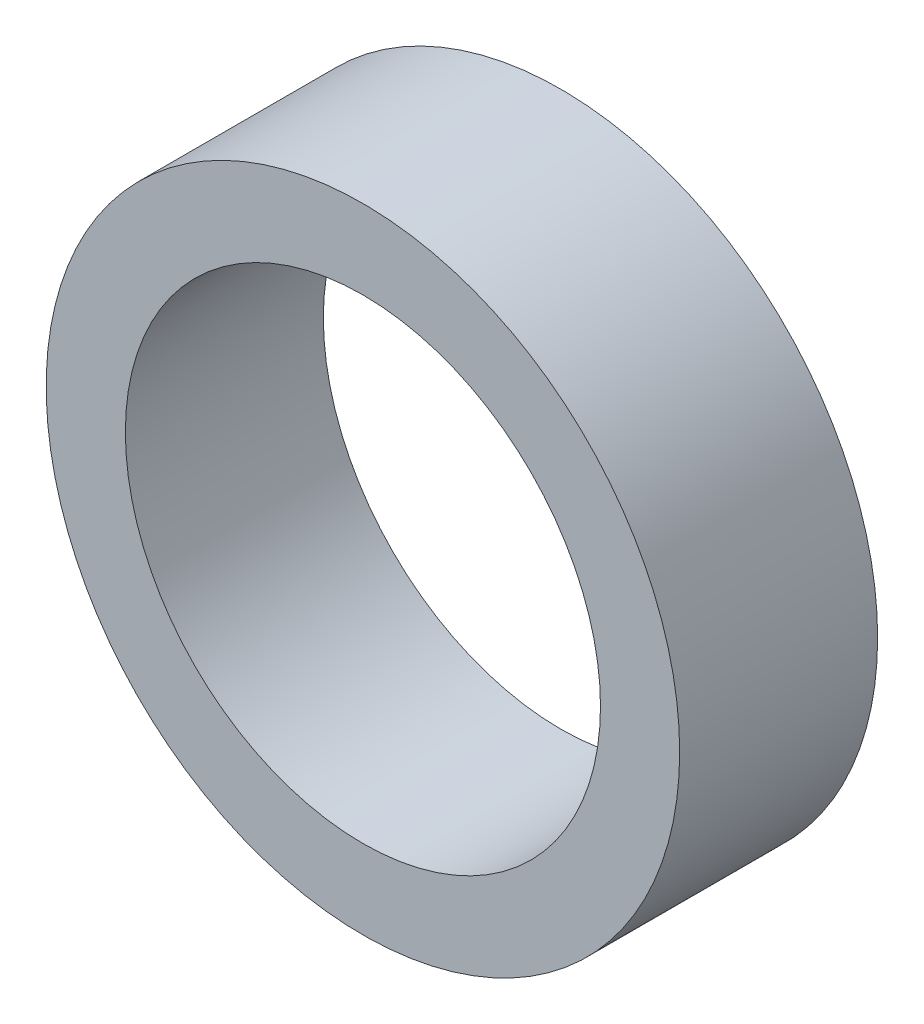
ISO-10303-21;
HEADER;
FILE_DESCRIPTION(('STEP AP214'),'2;1');
FILE_NAME('part.step','',(''),(''),'','','');
FILE_SCHEMA(('AUTOMOTIVE_DESIGN { 1 0 10303 214 1 1 1 1 }'));
ENDSEC;
DATA;
#1=APPLICATION_CONTEXT('core data for automotive mechanical design processes');
#2=APPLICATION_PROTOCOL_DEFINITION('international standard','automotive_design',2000,#1);
#3=PRODUCT_CONTEXT('',#1,'mechanical');
#4=PRODUCT('Part','Part','',(#3));
#5=PRODUCT_RELATED_PRODUCT_CATEGORY('part','',(#4));
#6=PRODUCT_DEFINITION_FORMATION('','',#4);
#7=PRODUCT_DEFINITION_CONTEXT('part definition',#1,'design');
#8=PRODUCT_DEFINITION('design','',#6,#7);
#9=PRODUCT_DEFINITION_SHAPE('','',#8);
#10=(LENGTH_UNIT() NAMED_UNIT(*) SI_UNIT(.MILLI.,.METRE.));
#11=(NAMED_UNIT(*) PLANE_ANGLE_UNIT() SI_UNIT($,.RADIAN.));
#12=(NAMED_UNIT(*) SI_UNIT($,.STERADIAN.) SOLID_ANGLE_UNIT());
#13=UNCERTAINTY_MEASURE_WITH_UNIT(LENGTH_MEASURE(1.E-05),#10,'distance_accuracy_value','');
#14=(GEOMETRIC_REPRESENTATION_CONTEXT(3) GLOBAL_UNCERTAINTY_ASSIGNED_CONTEXT((#13)) GLOBAL_UNIT_ASSIGNED_CONTEXT((#10,
#11,#12)) REPRESENTATION_CONTEXT('',''));
#15=CARTESIAN_POINT('',(0.,0.,0.));
#16=DIRECTION('',(0.,0.,1.));
#17=DIRECTION('',(1.,0.,0.));
#18=AXIS2_PLACEMENT_3D('',#15,#16,#17);
#19=CARTESIAN_POINT('',(0.,0.,40.));
#20=DIRECTION('',(0.,0.,-1.));
#21=DIRECTION('',(-1.,0.,0.));
#22=AXIS2_PLACEMENT_3D('',#19,#20,#21);
#23=CYLINDRICAL_SURFACE('',#22,112.);
#24=CARTESIAN_POINT('',(0.,0.,40.));
#25=DIRECTION('',(0.,0.,1.));
#26=DIRECTION('',(1.,0.,0.));
#27=AXIS2_PLACEMENT_3D('',#24,#25,#26);
#28=CIRCLE('',#27,112.);
#29=CARTESIAN_POINT('',(112.,0.,40.));
#30=VERTEX_POINT('',#29);
#31=EDGE_CURVE('E10',#30,#30,#28,.T.);
#32=ORIENTED_EDGE('',*,*,#31,.F.);
#33=EDGE_LOOP('',(#32));
#34=FACE_BOUND('',#33,.T.);
#35=CARTESIAN_POINT('',(0.,0.,-30.));
#36=DIRECTION('',(0.,0.,1.));
#37=DIRECTION('',(1.,0.,0.));
#38=AXIS2_PLACEMENT_3D('',#35,#36,#37);
#39=CIRCLE('',#38,112.);
#40=CARTESIAN_POINT('',(112.,0.,-30.));
#41=VERTEX_POINT('',#40);
#42=EDGE_CURVE('E39',#41,#41,#39,.T.);
#43=ORIENTED_EDGE('',*,*,#42,.T.);
#44=EDGE_LOOP('',(#43));
#45=FACE_BOUND('',#44,.T.);
#46=ADVANCED_FACE('F36',(#34,#45),#23,.T.);
#47=CARTESIAN_POINT('',(0.,0.,40.));
#48=DIRECTION('',(0.,0.,1.));
#49=DIRECTION('',(1.,0.,0.));
#50=AXIS2_PLACEMENT_3D('',#47,#48,#49);
#51=PLANE('',#50);
#52=CARTESIAN_POINT('',(0.,0.,40.));
#53=DIRECTION('',(0.,0.,1.));
#54=DIRECTION('',(1.,0.,0.));
#55=AXIS2_PLACEMENT_3D('',#52,#53,#54);
#56=CIRCLE('',#55,84.);
#57=CARTESIAN_POINT('',(84.,0.,40.));
#58=VERTEX_POINT('',#57);
#59=EDGE_CURVE('E48',#58,#58,#56,.T.);
#60=ORIENTED_EDGE('',*,*,#59,.F.);
#61=EDGE_LOOP('',(#60));
#62=FACE_BOUND('',#61,.T.);
#63=ORIENTED_EDGE('',*,*,#31,.T.);
#64=EDGE_LOOP('',(#63));
#65=FACE_BOUND('',#64,.T.);
#66=ADVANCED_FACE('F63',(#62,#65),#51,.T.);
#67=CARTESIAN_POINT('',(0.,0.,-30.));
#68=DIRECTION('',(0.,0.,1.));
#69=DIRECTION('',(1.,0.,0.));
#70=AXIS2_PLACEMENT_3D('',#67,#68,#69);
#71=PLANE('',#70);
#72=CARTESIAN_POINT('',(0.,0.,-30.));
#73=DIRECTION('',(0.,0.,1.));
#74=DIRECTION('',(1.,0.,0.));
#75=AXIS2_PLACEMENT_3D('',#72,#73,#74);
#76=CIRCLE('',#75,84.);
#77=CARTESIAN_POINT('',(84.,0.,-30.));
#78=VERTEX_POINT('',#77);
#79=EDGE_CURVE('E46',#78,#78,#76,.T.);
#80=ORIENTED_EDGE('',*,*,#79,.T.);
#81=EDGE_LOOP('',(#80));
#82=FACE_BOUND('',#81,.T.);
#83=ORIENTED_EDGE('',*,*,#42,.F.);
#84=EDGE_LOOP('',(#83));
#85=FACE_BOUND('',#84,.T.);
#86=ADVANCED_FACE('F54',(#82,#85),#71,.F.);
#87=CARTESIAN_POINT('',(0.,0.,-30.));
#88=DIRECTION('',(0.,0.,1.));
#89=DIRECTION('',(1.,0.,0.));
#90=AXIS2_PLACEMENT_3D('',#87,#88,#89);
#91=CYLINDRICAL_SURFACE('',#90,84.);
#92=ORIENTED_EDGE('',*,*,#79,.F.);
#93=EDGE_LOOP('',(#92));
#94=FACE_BOUND('',#93,.T.);
#95=ORIENTED_EDGE('',*,*,#59,.T.);
#96=EDGE_LOOP('',(#95));
#97=FACE_BOUND('',#96,.T.);
#98=ADVANCED_FACE('F57',(#94,#97),#91,.F.);
#99=CLOSED_SHELL('',(#46,#66,#86,#98));
#100=MANIFOLD_SOLID_BREP('B2',#99);
#101=ADVANCED_BREP_SHAPE_REPRESENTATION('',(#18,#100),#14);
#102=SHAPE_DEFINITION_REPRESENTATION(#9,#101);
ENDSEC;
END-ISO-10303-21;
